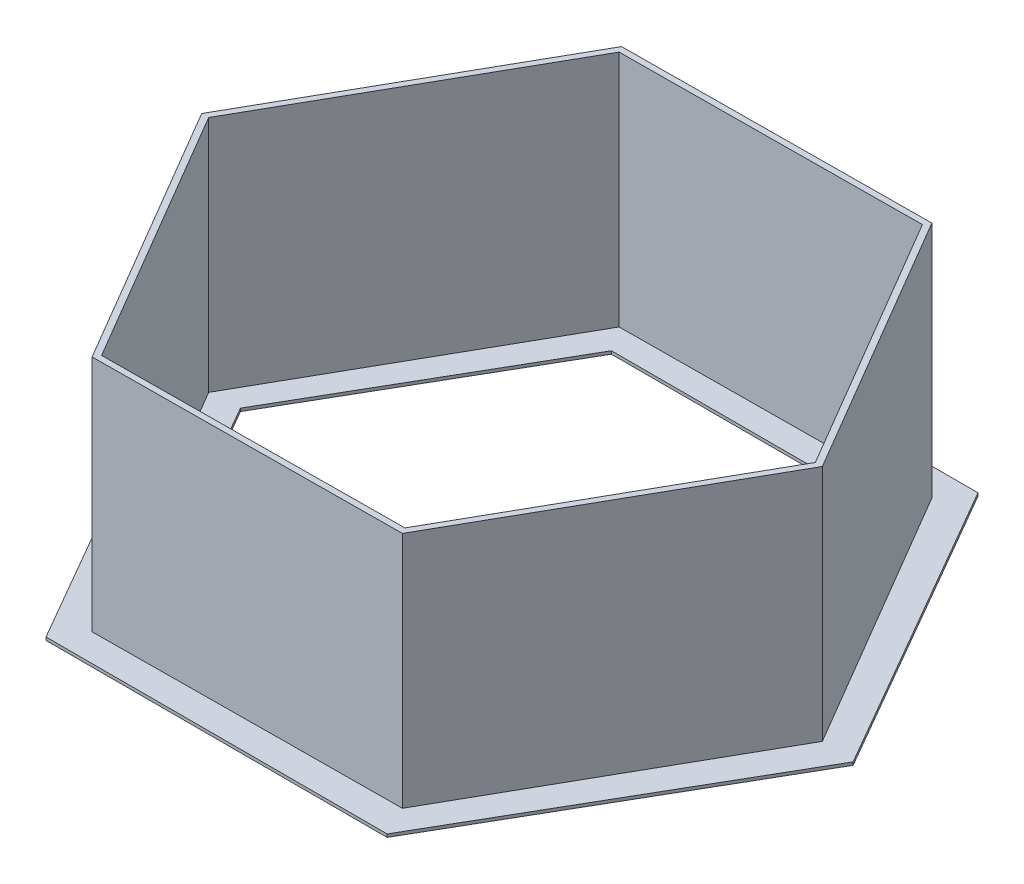
ISO-10303-21;
HEADER;
FILE_DESCRIPTION(('STEP AP214'),'2;1');
FILE_NAME('part.step','',(''),(''),'','','');
FILE_SCHEMA(('AUTOMOTIVE_DESIGN { 1 0 10303 214 1 1 1 1 }'));
ENDSEC;
DATA;
#1=APPLICATION_CONTEXT('core data for automotive mechanical design processes');
#2=APPLICATION_PROTOCOL_DEFINITION('international standard','automotive_design',2000,#1);
#3=PRODUCT_CONTEXT('',#1,'mechanical');
#4=PRODUCT('Part','Part','',(#3));
#5=PRODUCT_RELATED_PRODUCT_CATEGORY('part','',(#4));
#6=PRODUCT_DEFINITION_FORMATION('','',#4);
#7=PRODUCT_DEFINITION_CONTEXT('part definition',#1,'design');
#8=PRODUCT_DEFINITION('design','',#6,#7);
#9=PRODUCT_DEFINITION_SHAPE('','',#8);
#10=(LENGTH_UNIT() NAMED_UNIT(*) SI_UNIT(.MILLI.,.METRE.));
#11=(NAMED_UNIT(*) PLANE_ANGLE_UNIT() SI_UNIT($,.RADIAN.));
#12=(NAMED_UNIT(*) SI_UNIT($,.STERADIAN.) SOLID_ANGLE_UNIT());
#13=UNCERTAINTY_MEASURE_WITH_UNIT(LENGTH_MEASURE(1.E-05),#10,'distance_accuracy_value','');
#14=(GEOMETRIC_REPRESENTATION_CONTEXT(3) GLOBAL_UNCERTAINTY_ASSIGNED_CONTEXT((#13)) GLOBAL_UNIT_ASSIGNED_CONTEXT((#10,
#11,#12)) REPRESENTATION_CONTEXT('',''));
#15=CARTESIAN_POINT('',(0.,0.,0.));
#16=DIRECTION('',(0.,0.,1.));
#17=DIRECTION('',(1.,0.,0.));
#18=AXIS2_PLACEMENT_3D('',#15,#16,#17);
#19=CARTESIAN_POINT('',(0.,2.54,0.));
#20=DIRECTION('',(0.,1.,0.));
#21=DIRECTION('',(0.,0.,1.));
#22=AXIS2_PLACEMENT_3D('',#19,#20,#21);
#23=PLANE('',#22);
#24=DIRECTION('',(1.,0.,0.));
#25=VECTOR('',#24,1.);
#26=CARTESIAN_POINT('',(-143.769509273684,2.54,249.016094641265));
#27=LINE('',#26,#25);
#28=CARTESIAN_POINT('',(-143.769509273684,2.54,249.016094641265));
#29=VERTEX_POINT('',#28);
#30=CARTESIAN_POINT('',(143.769509273684,2.54,249.016094641265));
#31=VERTEX_POINT('',#30);
#32=EDGE_CURVE('E346',#29,#31,#27,.T.);
#33=ORIENTED_EDGE('',*,*,#32,.T.);
#34=DIRECTION('',(0.5,0.,-0.866025403784439));
#35=VECTOR('',#34,1.);
#36=CARTESIAN_POINT('',(143.769509273684,2.54,249.016094641265));
#37=LINE('',#36,#35);
#38=CARTESIAN_POINT('',(287.539018547367,2.54,0.));
#39=VERTEX_POINT('',#38);
#40=EDGE_CURVE('E349',#31,#39,#37,.T.);
#41=ORIENTED_EDGE('',*,*,#40,.T.);
#42=DIRECTION('',(-0.5,0.,-0.866025403784438));
#43=VECTOR('',#42,1.);
#44=CARTESIAN_POINT('',(287.539018547367,2.54,0.));
#45=LINE('',#44,#43);
#46=CARTESIAN_POINT('',(143.769509273683,2.54,-249.016094641265));
#47=VERTEX_POINT('',#46);
#48=EDGE_CURVE('E352',#39,#47,#45,.T.);
#49=ORIENTED_EDGE('',*,*,#48,.T.);
#50=DIRECTION('',(-1.,0.,0.));
#51=VECTOR('',#50,1.);
#52=CARTESIAN_POINT('',(143.769509273683,2.54,-249.016094641265));
#53=LINE('',#52,#51);
#54=CARTESIAN_POINT('',(-143.769509273684,2.54,-249.016094641265));
#55=VERTEX_POINT('',#54);
#56=EDGE_CURVE('E354',#47,#55,#53,.T.);
#57=ORIENTED_EDGE('',*,*,#56,.T.);
#58=DIRECTION('',(-0.5,0.,0.866025403784439));
#59=VECTOR('',#58,1.);
#60=CARTESIAN_POINT('',(-143.769509273684,2.54,-249.016094641265));
#61=LINE('',#60,#59);
#62=CARTESIAN_POINT('',(-287.539018547367,2.54,0.));
#63=VERTEX_POINT('',#62);
#64=EDGE_CURVE('E356',#55,#63,#61,.T.);
#65=ORIENTED_EDGE('',*,*,#64,.T.);
#66=DIRECTION('',(0.5,0.,0.866025403784439));
#67=VECTOR('',#66,1.);
#68=CARTESIAN_POINT('',(-287.539018547367,2.54,0.));
#69=LINE('',#68,#67);
#70=EDGE_CURVE('E358',#63,#29,#69,.T.);
#71=ORIENTED_EDGE('',*,*,#70,.T.);
#72=EDGE_LOOP('',(#33,#41,#49,#57,#65,#71));
#73=FACE_BOUND('',#72,.T.);
#74=DIRECTION('',(0.999971432611545,0.,-0.00755870100052161));
#75=VECTOR('',#74,1.);
#76=CARTESIAN_POINT('',(-1.69953154297277,2.54,-224.837970396992));
#77=LINE('',#76,#75);
#78=CARTESIAN_POINT('',(-131.509794275725,2.53999999999999,-223.85674540316));
#79=VERTEX_POINT('',#78);
#80=CARTESIAN_POINT('',(128.11073118978,2.53999999999999,-225.819195390823));
#81=VERTEX_POINT('',#80);
#82=EDGE_CURVE('E294',#79,#81,#77,.T.);
#83=ORIENTED_EDGE('',*,*,#82,.T.);
#84=DIRECTION('',(0.506531743391835,0.,0.862221313200056));
#85=VECTOR('',#84,1.);
#86=CARTESIAN_POINT('',(193.865628327642,2.54,-113.890822689243));
#87=LINE('',#86,#85);
#88=CARTESIAN_POINT('',(259.620525465505,2.53999999999999,-1.96244998766324));
#89=VERTEX_POINT('',#88);
#90=EDGE_CURVE('E297',#81,#89,#87,.T.);
#91=ORIENTED_EDGE('',*,*,#90,.T.);
#92=DIRECTION('',(-0.493439689219709,0.,0.869780014200578));
#93=VECTOR('',#92,1.);
#94=CARTESIAN_POINT('',(195.565159870615,2.54,110.947147707748));
#95=LINE('',#94,#93);
#96=CARTESIAN_POINT('',(131.509794275725,2.54,223.85674540316));
#97=VERTEX_POINT('',#96);
#98=EDGE_CURVE('E282',#89,#97,#95,.T.);
#99=ORIENTED_EDGE('',*,*,#98,.T.);
#100=DIRECTION('',(-0.999971432611545,0.,0.00755870100052183));
#101=VECTOR('',#100,1.);
#102=CARTESIAN_POINT('',(1.69953154297282,2.54,224.837970396992));
#103=LINE('',#102,#101);
#104=CARTESIAN_POINT('',(-128.110731189779,2.53999999999999,225.819195390824));
#105=VERTEX_POINT('',#104);
#106=EDGE_CURVE('E285',#97,#105,#103,.T.);
#107=ORIENTED_EDGE('',*,*,#106,.T.);
#108=DIRECTION('',(-0.506531743391835,0.,-0.862221313200056));
#109=VECTOR('',#108,1.);
#110=CARTESIAN_POINT('',(-193.865628327642,2.54,113.890822689243));
#111=LINE('',#110,#109);
#112=CARTESIAN_POINT('',(-259.620525465505,2.53999999999999,1.96244998766323));
#113=VERTEX_POINT('',#112);
#114=EDGE_CURVE('E288',#105,#113,#111,.T.);
#115=ORIENTED_EDGE('',*,*,#114,.T.);
#116=DIRECTION('',(0.49343968921971,0.,-0.869780014200577));
#117=VECTOR('',#116,1.);
#118=CARTESIAN_POINT('',(-195.565159870615,2.54,-110.947147707748));
#119=LINE('',#118,#117);
#120=EDGE_CURVE('E291',#113,#79,#119,.T.);
#121=ORIENTED_EDGE('',*,*,#120,.T.);
#122=EDGE_LOOP('',(#83,#91,#99,#107,#115,#121));
#123=FACE_BOUND('',#122,.T.);
#124=ADVANCED_FACE('F33',(#73,#123),#23,.T.);
#125=DIRECTION('',(0.506531743391835,0.,0.862221313200056));
#126=VECTOR('',#125,1.);
#127=CARTESIAN_POINT('',(189.485544056586,2.54,-111.317641432813));
#128=LINE('',#127,#126);
#129=CARTESIAN_POINT('',(125.216273809797,2.54,-220.717171301425));
#130=VERTEX_POINT('',#129);
#131=CARTESIAN_POINT('',(253.754814303375,2.54,-1.91811156420028));
#132=VERTEX_POINT('',#131);
#133=EDGE_CURVE('E56',#130,#132,#128,.T.);
#134=ORIENTED_EDGE('',*,*,#133,.F.);
#135=DIRECTION('',(0.999971432611545,0.,-0.00755870100052148));
#136=VECTOR('',#135,1.);
#137=CARTESIAN_POINT('',(-1.66113334189009,2.54,-219.758115519325));
#138=LINE('',#137,#136);
#139=CARTESIAN_POINT('',(-128.538540493577,2.54,-218.799059737225));
#140=VERTEX_POINT('',#139);
#141=EDGE_CURVE('E211',#140,#130,#138,.T.);
#142=ORIENTED_EDGE('',*,*,#141,.F.);
#143=DIRECTION('',(0.493439689219709,0.,-0.869780014200577));
#144=VECTOR('',#143,1.);
#145=CARTESIAN_POINT('',(-191.146677398476,2.54,-108.440474086512));
#146=LINE('',#145,#144);
#147=CARTESIAN_POINT('',(-253.754814303374,2.54,1.9181115642003));
#148=VERTEX_POINT('',#147);
#149=EDGE_CURVE('E277',#148,#140,#146,.T.);
#150=ORIENTED_EDGE('',*,*,#149,.F.);
#151=DIRECTION('',(-0.506531743391835,0.,-0.862221313200055));
#152=VECTOR('',#151,1.);
#153=CARTESIAN_POINT('',(-189.485544056586,2.54,111.317641432813));
#154=LINE('',#153,#152);
#155=CARTESIAN_POINT('',(-125.216273809797,2.54,220.717171301425));
#156=VERTEX_POINT('',#155);
#157=EDGE_CURVE('E274',#156,#148,#154,.T.);
#158=ORIENTED_EDGE('',*,*,#157,.F.);
#159=DIRECTION('',(-0.999971432611545,0.,0.0075587010005217));
#160=VECTOR('',#159,1.);
#161=CARTESIAN_POINT('',(1.66113334189014,2.54,219.758115519325));
#162=LINE('',#161,#160);
#163=CARTESIAN_POINT('',(128.538540493577,2.53999999999999,218.799059737225));
#164=VERTEX_POINT('',#163);
#165=EDGE_CURVE('E271',#164,#156,#162,.T.);
#166=ORIENTED_EDGE('',*,*,#165,.F.);
#167=DIRECTION('',(-0.493439689219709,0.,0.869780014200577));
#168=VECTOR('',#167,1.);
#169=CARTESIAN_POINT('',(191.146677398476,2.54,108.440474086512));
#170=LINE('',#169,#168);
#171=EDGE_CURVE('E268',#132,#164,#170,.T.);
#172=ORIENTED_EDGE('',*,*,#171,.F.);
#173=EDGE_LOOP('',(#134,#142,#150,#158,#166,#172));
#174=FACE_BOUND('',#173,.T.);
#175=DIRECTION('',(0.5,0.,-0.866025403784439));
#176=VECTOR('',#175,1.);
#177=CARTESIAN_POINT('',(114.440115598851,2.54,198.216094641265));
#178=LINE('',#177,#176);
#179=CARTESIAN_POINT('',(114.440115598851,2.54,198.216094641265));
#180=VERTEX_POINT('',#179);
#181=CARTESIAN_POINT('',(228.880231197701,2.54,0.));
#182=VERTEX_POINT('',#181);
#183=EDGE_CURVE('E303',#180,#182,#178,.T.);
#184=ORIENTED_EDGE('',*,*,#183,.F.);
#185=DIRECTION('',(1.,0.,0.));
#186=VECTOR('',#185,1.);
#187=CARTESIAN_POINT('',(-114.440115598851,2.54,198.216094641265));
#188=LINE('',#187,#186);
#189=CARTESIAN_POINT('',(-114.440115598851,2.54,198.216094641265));
#190=VERTEX_POINT('',#189);
#191=EDGE_CURVE('E301',#190,#180,#188,.T.);
#192=ORIENTED_EDGE('',*,*,#191,.F.);
#193=DIRECTION('',(0.5,0.,0.866025403784439));
#194=VECTOR('',#193,1.);
#195=CARTESIAN_POINT('',(-228.880231197701,2.54,0.));
#196=LINE('',#195,#194);
#197=CARTESIAN_POINT('',(-228.880231197701,2.54,0.));
#198=VERTEX_POINT('',#197);
#199=EDGE_CURVE('E313',#198,#190,#196,.T.);
#200=ORIENTED_EDGE('',*,*,#199,.F.);
#201=DIRECTION('',(-0.5,0.,0.866025403784439));
#202=VECTOR('',#201,1.);
#203=CARTESIAN_POINT('',(-114.440115598851,2.54,-198.216094641265));
#204=LINE('',#203,#202);
#205=CARTESIAN_POINT('',(-114.440115598851,2.54,-198.216094641265));
#206=VERTEX_POINT('',#205);
#207=EDGE_CURVE('E310',#206,#198,#204,.T.);
#208=ORIENTED_EDGE('',*,*,#207,.F.);
#209=DIRECTION('',(-1.,0.,0.));
#210=VECTOR('',#209,1.);
#211=CARTESIAN_POINT('',(114.440115598851,2.54,-198.216094641265));
#212=LINE('',#211,#210);
#213=CARTESIAN_POINT('',(114.440115598851,2.54,-198.216094641265));
#214=VERTEX_POINT('',#213);
#215=EDGE_CURVE('E308',#214,#206,#212,.T.);
#216=ORIENTED_EDGE('',*,*,#215,.F.);
#217=DIRECTION('',(-0.5,0.,-0.866025403784438));
#218=VECTOR('',#217,1.);
#219=CARTESIAN_POINT('',(228.880231197701,2.54,0.));
#220=LINE('',#219,#218);
#221=EDGE_CURVE('E306',#182,#214,#220,.T.);
#222=ORIENTED_EDGE('',*,*,#221,.F.);
#223=EDGE_LOOP('',(#184,#192,#200,#208,#216,#222));
#224=FACE_BOUND('',#223,.T.);
#225=ADVANCED_FACE('F427',(#174,#224),#23,.T.);
#226=CARTESIAN_POINT('',(0.,0.,0.));
#227=DIRECTION('',(0.,1.,0.));
#228=DIRECTION('',(0.,0.,1.));
#229=AXIS2_PLACEMENT_3D('',#226,#227,#228);
#230=PLANE('',#229);
#231=DIRECTION('',(1.,0.,0.));
#232=VECTOR('',#231,1.);
#233=CARTESIAN_POINT('',(-114.440115598851,0.,198.216094641265));
#234=LINE('',#233,#232);
#235=CARTESIAN_POINT('',(-114.440115598851,0.,198.216094641265));
#236=VERTEX_POINT('',#235);
#237=CARTESIAN_POINT('',(114.440115598851,0.,198.216094641265));
#238=VERTEX_POINT('',#237);
#239=EDGE_CURVE('E300',#236,#238,#234,.T.);
#240=ORIENTED_EDGE('',*,*,#239,.T.);
#241=DIRECTION('',(0.5,0.,-0.866025403784439));
#242=VECTOR('',#241,1.);
#243=CARTESIAN_POINT('',(114.440115598851,0.,198.216094641265));
#244=LINE('',#243,#242);
#245=CARTESIAN_POINT('',(228.880231197701,0.,0.));
#246=VERTEX_POINT('',#245);
#247=EDGE_CURVE('E318',#238,#246,#244,.T.);
#248=ORIENTED_EDGE('',*,*,#247,.T.);
#249=DIRECTION('',(-0.5,0.,-0.866025403784438));
#250=VECTOR('',#249,1.);
#251=CARTESIAN_POINT('',(228.880231197701,0.,0.));
#252=LINE('',#251,#250);
#253=CARTESIAN_POINT('',(114.440115598851,0.,-198.216094641265));
#254=VERTEX_POINT('',#253);
#255=EDGE_CURVE('E321',#246,#254,#252,.T.);
#256=ORIENTED_EDGE('',*,*,#255,.T.);
#257=DIRECTION('',(-1.,0.,0.));
#258=VECTOR('',#257,1.);
#259=CARTESIAN_POINT('',(114.440115598851,0.,-198.216094641265));
#260=LINE('',#259,#258);
#261=CARTESIAN_POINT('',(-114.440115598851,0.,-198.216094641265));
#262=VERTEX_POINT('',#261);
#263=EDGE_CURVE('E324',#254,#262,#260,.T.);
#264=ORIENTED_EDGE('',*,*,#263,.T.);
#265=DIRECTION('',(-0.5,0.,0.866025403784439));
#266=VECTOR('',#265,1.);
#267=CARTESIAN_POINT('',(-114.440115598851,0.,-198.216094641265));
#268=LINE('',#267,#266);
#269=CARTESIAN_POINT('',(-228.880231197701,0.,0.));
#270=VERTEX_POINT('',#269);
#271=EDGE_CURVE('E327',#262,#270,#268,.T.);
#272=ORIENTED_EDGE('',*,*,#271,.T.);
#273=DIRECTION('',(0.5,0.,0.866025403784439));
#274=VECTOR('',#273,1.);
#275=CARTESIAN_POINT('',(-228.880231197701,0.,0.));
#276=LINE('',#275,#274);
#277=EDGE_CURVE('E304',#270,#236,#276,.T.);
#278=ORIENTED_EDGE('',*,*,#277,.T.);
#279=EDGE_LOOP('',(#240,#248,#256,#264,#272,#278));
#280=FACE_BOUND('',#279,.T.);
#281=DIRECTION('',(1.,0.,0.));
#282=VECTOR('',#281,1.);
#283=CARTESIAN_POINT('',(-143.769509273684,0.,249.016094641265));
#284=LINE('',#283,#282);
#285=CARTESIAN_POINT('',(-143.769509273684,0.,249.016094641265));
#286=VERTEX_POINT('',#285);
#287=CARTESIAN_POINT('',(143.769509273684,0.,249.016094641265));
#288=VERTEX_POINT('',#287);
#289=EDGE_CURVE('E345',#286,#288,#284,.T.);
#290=ORIENTED_EDGE('',*,*,#289,.F.);
#291=DIRECTION('',(0.5,0.,0.866025403784439));
#292=VECTOR('',#291,1.);
#293=CARTESIAN_POINT('',(-287.539018547367,0.,0.));
#294=LINE('',#293,#292);
#295=CARTESIAN_POINT('',(-287.539018547367,0.,0.));
#296=VERTEX_POINT('',#295);
#297=EDGE_CURVE('E350',#296,#286,#294,.T.);
#298=ORIENTED_EDGE('',*,*,#297,.F.);
#299=DIRECTION('',(-0.5,0.,0.866025403784439));
#300=VECTOR('',#299,1.);
#301=CARTESIAN_POINT('',(-143.769509273684,0.,-249.016094641265));
#302=LINE('',#301,#300);
#303=CARTESIAN_POINT('',(-143.769509273684,0.,-249.016094641265));
#304=VERTEX_POINT('',#303);
#305=EDGE_CURVE('E369',#304,#296,#302,.T.);
#306=ORIENTED_EDGE('',*,*,#305,.F.);
#307=DIRECTION('',(-1.,0.,0.));
#308=VECTOR('',#307,1.);
#309=CARTESIAN_POINT('',(143.769509273683,0.,-249.016094641265));
#310=LINE('',#309,#308);
#311=CARTESIAN_POINT('',(143.769509273683,0.,-249.016094641265));
#312=VERTEX_POINT('',#311);
#313=EDGE_CURVE('E367',#312,#304,#310,.T.);
#314=ORIENTED_EDGE('',*,*,#313,.F.);
#315=DIRECTION('',(-0.5,0.,-0.866025403784438));
#316=VECTOR('',#315,1.);
#317=CARTESIAN_POINT('',(287.539018547367,0.,0.));
#318=LINE('',#317,#316);
#319=CARTESIAN_POINT('',(287.539018547367,0.,0.));
#320=VERTEX_POINT('',#319);
#321=EDGE_CURVE('E365',#320,#312,#318,.T.);
#322=ORIENTED_EDGE('',*,*,#321,.F.);
#323=DIRECTION('',(0.5,0.,-0.866025403784439));
#324=VECTOR('',#323,1.);
#325=CARTESIAN_POINT('',(143.769509273684,0.,249.016094641265));
#326=LINE('',#325,#324);
#327=EDGE_CURVE('E363',#288,#320,#326,.T.);
#328=ORIENTED_EDGE('',*,*,#327,.F.);
#329=EDGE_LOOP('',(#290,#298,#306,#314,#322,#328));
#330=FACE_BOUND('',#329,.T.);
#331=ADVANCED_FACE('F393',(#280,#330),#230,.F.);
#332=CARTESIAN_POINT('',(-143.769509273684,2.54,249.016094641265));
#333=DIRECTION('',(0.,0.,-1.));
#334=DIRECTION('',(-1.,0.,0.));
#335=AXIS2_PLACEMENT_3D('',#332,#333,#334);
#336=PLANE('',#335);
#337=ORIENTED_EDGE('',*,*,#289,.T.);
#338=DIRECTION('',(0.,-1.,0.));
#339=VECTOR('',#338,1.);
#340=CARTESIAN_POINT('',(143.769509273684,2.54,249.016094641265));
#341=LINE('',#340,#339);
#342=EDGE_CURVE('E11',#31,#288,#341,.T.);
#343=ORIENTED_EDGE('',*,*,#342,.F.);
#344=ORIENTED_EDGE('',*,*,#32,.F.);
#345=DIRECTION('',(0.,-1.,0.));
#346=VECTOR('',#345,1.);
#347=CARTESIAN_POINT('',(-143.769509273684,2.54,249.016094641265));
#348=LINE('',#347,#346);
#349=EDGE_CURVE('E360',#29,#286,#348,.T.);
#350=ORIENTED_EDGE('',*,*,#349,.T.);
#351=EDGE_LOOP('',(#337,#343,#344,#350));
#352=FACE_BOUND('',#351,.T.);
#353=ADVANCED_FACE('F35',(#352),#336,.F.);
#354=CARTESIAN_POINT('',(143.769509273684,2.54,249.016094641265));
#355=DIRECTION('',(-0.866025403784439,0.,-0.5));
#356=DIRECTION('',(-0.5,0.,0.866025403784439));
#357=AXIS2_PLACEMENT_3D('',#354,#355,#356);
#358=PLANE('',#357);
#359=ORIENTED_EDGE('',*,*,#327,.T.);
#360=DIRECTION('',(0.,-1.,0.));
#361=VECTOR('',#360,1.);
#362=CARTESIAN_POINT('',(287.539018547367,2.54,0.));
#363=LINE('',#362,#361);
#364=EDGE_CURVE('E41',#39,#320,#363,.T.);
#365=ORIENTED_EDGE('',*,*,#364,.F.);
#366=ORIENTED_EDGE('',*,*,#40,.F.);
#367=ORIENTED_EDGE('',*,*,#342,.T.);
#368=EDGE_LOOP('',(#359,#365,#366,#367));
#369=FACE_BOUND('',#368,.T.);
#370=ADVANCED_FACE('F410',(#369),#358,.F.);
#371=CARTESIAN_POINT('',(287.539018547367,2.54,0.));
#372=DIRECTION('',(-0.866025403784438,0.,0.5));
#373=DIRECTION('',(0.5,0.,0.866025403784438));
#374=AXIS2_PLACEMENT_3D('',#371,#372,#373);
#375=PLANE('',#374);
#376=ORIENTED_EDGE('',*,*,#321,.T.);
#377=DIRECTION('',(0.,-1.,0.));
#378=VECTOR('',#377,1.);
#379=CARTESIAN_POINT('',(143.769509273683,2.54,-249.016094641265));
#380=LINE('',#379,#378);
#381=EDGE_CURVE('E380',#47,#312,#380,.T.);
#382=ORIENTED_EDGE('',*,*,#381,.F.);
#383=ORIENTED_EDGE('',*,*,#48,.F.);
#384=ORIENTED_EDGE('',*,*,#364,.T.);
#385=EDGE_LOOP('',(#376,#382,#383,#384));
#386=FACE_BOUND('',#385,.T.);
#387=ADVANCED_FACE('F387',(#386),#375,.F.);
#388=CARTESIAN_POINT('',(143.769509273683,2.54,-249.016094641265));
#389=DIRECTION('',(0.,0.,1.));
#390=DIRECTION('',(1.,0.,0.));
#391=AXIS2_PLACEMENT_3D('',#388,#389,#390);
#392=PLANE('',#391);
#393=ORIENTED_EDGE('',*,*,#313,.T.);
#394=DIRECTION('',(0.,-1.,0.));
#395=VECTOR('',#394,1.);
#396=CARTESIAN_POINT('',(-143.769509273684,2.54,-249.016094641265));
#397=LINE('',#396,#395);
#398=EDGE_CURVE('E377',#55,#304,#397,.T.);
#399=ORIENTED_EDGE('',*,*,#398,.F.);
#400=ORIENTED_EDGE('',*,*,#56,.F.);
#401=ORIENTED_EDGE('',*,*,#381,.T.);
#402=EDGE_LOOP('',(#393,#399,#400,#401));
#403=FACE_BOUND('',#402,.T.);
#404=ADVANCED_FACE('F398',(#403),#392,.F.);
#405=CARTESIAN_POINT('',(-143.769509273684,2.54,-249.016094641265));
#406=DIRECTION('',(0.866025403784439,0.,0.5));
#407=DIRECTION('',(0.5,0.,-0.866025403784439));
#408=AXIS2_PLACEMENT_3D('',#405,#406,#407);
#409=PLANE('',#408);
#410=ORIENTED_EDGE('',*,*,#305,.T.);
#411=DIRECTION('',(0.,-1.,0.));
#412=VECTOR('',#411,1.);
#413=CARTESIAN_POINT('',(-287.539018547367,2.54,0.));
#414=LINE('',#413,#412);
#415=EDGE_CURVE('E374',#63,#296,#414,.T.);
#416=ORIENTED_EDGE('',*,*,#415,.F.);
#417=ORIENTED_EDGE('',*,*,#64,.F.);
#418=ORIENTED_EDGE('',*,*,#398,.T.);
#419=EDGE_LOOP('',(#410,#416,#417,#418));
#420=FACE_BOUND('',#419,.T.);
#421=ADVANCED_FACE('F402',(#420),#409,.F.);
#422=CARTESIAN_POINT('',(-287.539018547367,2.54,0.));
#423=DIRECTION('',(0.866025403784439,0.,-0.5));
#424=DIRECTION('',(-0.5,0.,-0.866025403784439));
#425=AXIS2_PLACEMENT_3D('',#422,#423,#424);
#426=PLANE('',#425);
#427=ORIENTED_EDGE('',*,*,#297,.T.);
#428=ORIENTED_EDGE('',*,*,#349,.F.);
#429=ORIENTED_EDGE('',*,*,#70,.F.);
#430=ORIENTED_EDGE('',*,*,#415,.T.);
#431=EDGE_LOOP('',(#427,#428,#429,#430));
#432=FACE_BOUND('',#431,.T.);
#433=ADVANCED_FACE('F413',(#432),#426,.F.);
#434=CARTESIAN_POINT('',(-114.440115598851,2.54,198.216094641265));
#435=DIRECTION('',(0.,0.,-1.));
#436=DIRECTION('',(-1.,0.,0.));
#437=AXIS2_PLACEMENT_3D('',#434,#435,#436);
#438=PLANE('',#437);
#439=ORIENTED_EDGE('',*,*,#239,.F.);
#440=DIRECTION('',(0.,-1.,0.));
#441=VECTOR('',#440,1.);
#442=CARTESIAN_POINT('',(-114.440115598851,2.54,198.216094641265));
#443=LINE('',#442,#441);
#444=EDGE_CURVE('E315',#190,#236,#443,.T.);
#445=ORIENTED_EDGE('',*,*,#444,.F.);
#446=ORIENTED_EDGE('',*,*,#191,.T.);
#447=DIRECTION('',(0.,-1.,0.));
#448=VECTOR('',#447,1.);
#449=CARTESIAN_POINT('',(114.440115598851,2.54,198.216094641265));
#450=LINE('',#449,#448);
#451=EDGE_CURVE('E342',#180,#238,#450,.T.);
#452=ORIENTED_EDGE('',*,*,#451,.T.);
#453=EDGE_LOOP('',(#439,#445,#446,#452));
#454=FACE_BOUND('',#453,.T.);
#455=ADVANCED_FACE('F415',(#454),#438,.T.);
#456=CARTESIAN_POINT('',(114.440115598851,2.54,198.216094641265));
#457=DIRECTION('',(-0.866025403784439,0.,-0.5));
#458=DIRECTION('',(-0.5,0.,0.866025403784439));
#459=AXIS2_PLACEMENT_3D('',#456,#457,#458);
#460=PLANE('',#459);
#461=ORIENTED_EDGE('',*,*,#247,.F.);
#462=ORIENTED_EDGE('',*,*,#451,.F.);
#463=ORIENTED_EDGE('',*,*,#183,.T.);
#464=DIRECTION('',(0.,-1.,0.));
#465=VECTOR('',#464,1.);
#466=CARTESIAN_POINT('',(228.880231197701,2.54,0.));
#467=LINE('',#466,#465);
#468=EDGE_CURVE('E340',#182,#246,#467,.T.);
#469=ORIENTED_EDGE('',*,*,#468,.T.);
#470=EDGE_LOOP('',(#461,#462,#463,#469));
#471=FACE_BOUND('',#470,.T.);
#472=ADVANCED_FACE('F421',(#471),#460,.T.);
#473=CARTESIAN_POINT('',(228.880231197701,2.54,0.));
#474=DIRECTION('',(-0.866025403784438,0.,0.5));
#475=DIRECTION('',(0.5,0.,0.866025403784438));
#476=AXIS2_PLACEMENT_3D('',#473,#474,#475);
#477=PLANE('',#476);
#478=ORIENTED_EDGE('',*,*,#255,.F.);
#479=ORIENTED_EDGE('',*,*,#468,.F.);
#480=ORIENTED_EDGE('',*,*,#221,.T.);
#481=DIRECTION('',(0.,-1.,0.));
#482=VECTOR('',#481,1.);
#483=CARTESIAN_POINT('',(114.440115598851,2.54,-198.216094641265));
#484=LINE('',#483,#482);
#485=EDGE_CURVE('E338',#214,#254,#484,.T.);
#486=ORIENTED_EDGE('',*,*,#485,.T.);
#487=EDGE_LOOP('',(#478,#479,#480,#486));
#488=FACE_BOUND('',#487,.T.);
#489=ADVANCED_FACE('F454',(#488),#477,.T.);
#490=CARTESIAN_POINT('',(114.440115598851,2.54,-198.216094641265));
#491=DIRECTION('',(0.,0.,1.));
#492=DIRECTION('',(1.,0.,0.));
#493=AXIS2_PLACEMENT_3D('',#490,#491,#492);
#494=PLANE('',#493);
#495=ORIENTED_EDGE('',*,*,#263,.F.);
#496=ORIENTED_EDGE('',*,*,#485,.F.);
#497=ORIENTED_EDGE('',*,*,#215,.T.);
#498=DIRECTION('',(0.,-1.,0.));
#499=VECTOR('',#498,1.);
#500=CARTESIAN_POINT('',(-114.440115598851,2.54,-198.216094641265));
#501=LINE('',#500,#499);
#502=EDGE_CURVE('E336',#206,#262,#501,.T.);
#503=ORIENTED_EDGE('',*,*,#502,.T.);
#504=EDGE_LOOP('',(#495,#496,#497,#503));
#505=FACE_BOUND('',#504,.T.);
#506=ADVANCED_FACE('F459',(#505),#494,.T.);
#507=CARTESIAN_POINT('',(-114.440115598851,2.54,-198.216094641265));
#508=DIRECTION('',(0.866025403784439,0.,0.5));
#509=DIRECTION('',(0.5,0.,-0.866025403784439));
#510=AXIS2_PLACEMENT_3D('',#507,#508,#509);
#511=PLANE('',#510);
#512=ORIENTED_EDGE('',*,*,#271,.F.);
#513=ORIENTED_EDGE('',*,*,#502,.F.);
#514=ORIENTED_EDGE('',*,*,#207,.T.);
#515=DIRECTION('',(0.,-1.,0.));
#516=VECTOR('',#515,1.);
#517=CARTESIAN_POINT('',(-228.880231197701,2.54,0.));
#518=LINE('',#517,#516);
#519=EDGE_CURVE('E334',#198,#270,#518,.T.);
#520=ORIENTED_EDGE('',*,*,#519,.T.);
#521=EDGE_LOOP('',(#512,#513,#514,#520));
#522=FACE_BOUND('',#521,.T.);
#523=ADVANCED_FACE('F462',(#522),#511,.T.);
#524=CARTESIAN_POINT('',(-228.880231197701,2.54,0.));
#525=DIRECTION('',(0.866025403784438,0.,-0.5));
#526=DIRECTION('',(-0.5,0.,-0.866025403784439));
#527=AXIS2_PLACEMENT_3D('',#524,#525,#526);
#528=PLANE('',#527);
#529=ORIENTED_EDGE('',*,*,#277,.F.);
#530=ORIENTED_EDGE('',*,*,#519,.F.);
#531=ORIENTED_EDGE('',*,*,#199,.T.);
#532=ORIENTED_EDGE('',*,*,#444,.T.);
#533=EDGE_LOOP('',(#529,#530,#531,#532));
#534=FACE_BOUND('',#533,.T.);
#535=ADVANCED_FACE('F443',(#534),#528,.T.);
#536=CARTESIAN_POINT('',(0.,203.2,0.));
#537=DIRECTION('',(0.,1.,0.));
#538=DIRECTION('',(0.,0.,1.));
#539=AXIS2_PLACEMENT_3D('',#536,#537,#538);
#540=PLANE('',#539);
#541=DIRECTION('',(-0.506531743391835,0.,-0.862221313200056));
#542=VECTOR('',#541,1.);
#543=CARTESIAN_POINT('',(259.620525465505,203.2,-1.96244998766324));
#544=LINE('',#543,#542);
#545=CARTESIAN_POINT('',(259.620525465505,203.2,-1.96244998766324));
#546=VERTEX_POINT('',#545);
#547=CARTESIAN_POINT('',(128.11073118978,203.2,-225.819195390823));
#548=VERTEX_POINT('',#547);
#549=EDGE_CURVE('E212',#546,#548,#544,.T.);
#550=ORIENTED_EDGE('',*,*,#549,.T.);
#551=DIRECTION('',(-0.999971432611545,0.,0.00755870100052161));
#552=VECTOR('',#551,1.);
#553=CARTESIAN_POINT('',(128.11073118978,203.2,-225.819195390823));
#554=LINE('',#553,#552);
#555=CARTESIAN_POINT('',(-131.509794275725,203.2,-223.85674540316));
#556=VERTEX_POINT('',#555);
#557=EDGE_CURVE('E242',#548,#556,#554,.T.);
#558=ORIENTED_EDGE('',*,*,#557,.T.);
#559=DIRECTION('',(-0.49343968921971,0.,0.869780014200577));
#560=VECTOR('',#559,1.);
#561=CARTESIAN_POINT('',(-131.509794275725,203.2,-223.85674540316));
#562=LINE('',#561,#560);
#563=CARTESIAN_POINT('',(-259.620525465505,203.2,1.96244998766323));
#564=VERTEX_POINT('',#563);
#565=EDGE_CURVE('E244',#556,#564,#562,.T.);
#566=ORIENTED_EDGE('',*,*,#565,.T.);
#567=DIRECTION('',(0.506531743391835,0.,0.862221313200055));
#568=VECTOR('',#567,1.);
#569=CARTESIAN_POINT('',(-259.620525465505,203.2,1.96244998766323));
#570=LINE('',#569,#568);
#571=CARTESIAN_POINT('',(-128.110731189779,203.2,225.819195390824));
#572=VERTEX_POINT('',#571);
#573=EDGE_CURVE('E246',#564,#572,#570,.T.);
#574=ORIENTED_EDGE('',*,*,#573,.T.);
#575=DIRECTION('',(0.999971432611545,0.,-0.00755870100052183));
#576=VECTOR('',#575,1.);
#577=CARTESIAN_POINT('',(-128.110731189779,203.2,225.819195390824));
#578=LINE('',#577,#576);
#579=CARTESIAN_POINT('',(131.509794275725,203.2,223.85674540316));
#580=VERTEX_POINT('',#579);
#581=EDGE_CURVE('E248',#572,#580,#578,.T.);
#582=ORIENTED_EDGE('',*,*,#581,.T.);
#583=DIRECTION('',(0.493439689219709,0.,-0.869780014200578));
#584=VECTOR('',#583,1.);
#585=CARTESIAN_POINT('',(131.509794275725,203.2,223.85674540316));
#586=LINE('',#585,#584);
#587=EDGE_CURVE('E250',#580,#546,#586,.T.);
#588=ORIENTED_EDGE('',*,*,#587,.T.);
#589=EDGE_LOOP('',(#550,#558,#566,#574,#582,#588));
#590=FACE_BOUND('',#589,.T.);
#591=DIRECTION('',(-0.999971432611545,0.,0.00755870100052148));
#592=VECTOR('',#591,1.);
#593=CARTESIAN_POINT('',(125.216273809797,203.2,-220.717171301425));
#594=LINE('',#593,#592);
#595=CARTESIAN_POINT('',(125.216273809797,203.2,-220.717171301425));
#596=VERTEX_POINT('',#595);
#597=CARTESIAN_POINT('',(-128.538540493577,203.2,-218.799059737225));
#598=VERTEX_POINT('',#597);
#599=EDGE_CURVE('E205',#596,#598,#594,.T.);
#600=ORIENTED_EDGE('',*,*,#599,.F.);
#601=DIRECTION('',(-0.506531743391835,0.,-0.862221313200056));
#602=VECTOR('',#601,1.);
#603=CARTESIAN_POINT('',(253.754814303374,203.2,-1.91811156420028));
#604=LINE('',#603,#602);
#605=CARTESIAN_POINT('',(253.754814303374,203.2,-1.91811156420028));
#606=VERTEX_POINT('',#605);
#607=EDGE_CURVE('E196',#606,#596,#604,.T.);
#608=ORIENTED_EDGE('',*,*,#607,.F.);
#609=DIRECTION('',(0.493439689219709,0.,-0.869780014200577));
#610=VECTOR('',#609,1.);
#611=CARTESIAN_POINT('',(128.538540493577,203.2,218.799059737225));
#612=LINE('',#611,#610);
#613=CARTESIAN_POINT('',(128.538540493578,203.2,218.799059737225));
#614=VERTEX_POINT('',#613);
#615=EDGE_CURVE('E227',#614,#606,#612,.T.);
#616=ORIENTED_EDGE('',*,*,#615,.F.);
#617=DIRECTION('',(0.999971432611545,0.,-0.0075587010005217));
#618=VECTOR('',#617,1.);
#619=CARTESIAN_POINT('',(-125.216273809797,203.2,220.717171301425));
#620=LINE('',#619,#618);
#621=CARTESIAN_POINT('',(-125.216273809797,203.2,220.717171301425));
#622=VERTEX_POINT('',#621);
#623=EDGE_CURVE('E224',#622,#614,#620,.T.);
#624=ORIENTED_EDGE('',*,*,#623,.F.);
#625=DIRECTION('',(0.506531743391835,0.,0.862221313200055));
#626=VECTOR('',#625,1.);
#627=CARTESIAN_POINT('',(-253.754814303374,203.2,1.9181115642003));
#628=LINE('',#627,#626);
#629=CARTESIAN_POINT('',(-253.754814303374,203.2,1.9181115642003));
#630=VERTEX_POINT('',#629);
#631=EDGE_CURVE('E220',#630,#622,#628,.T.);
#632=ORIENTED_EDGE('',*,*,#631,.F.);
#633=DIRECTION('',(-0.49343968921971,0.,0.869780014200577));
#634=VECTOR('',#633,1.);
#635=CARTESIAN_POINT('',(-128.538540493577,203.2,-218.799059737225));
#636=LINE('',#635,#634);
#637=EDGE_CURVE('E218',#598,#630,#636,.T.);
#638=ORIENTED_EDGE('',*,*,#637,.F.);
#639=EDGE_LOOP('',(#600,#608,#616,#624,#632,#638));
#640=FACE_BOUND('',#639,.T.);
#641=ADVANCED_FACE('F216',(#590,#640),#540,.T.);
#642=CARTESIAN_POINT('',(259.620525465505,203.2,-1.96244998766324));
#643=DIRECTION('',(-0.862221313200055,0.,0.506531743391835));
#644=DIRECTION('',(0.506531743391835,0.,0.862221313200056));
#645=AXIS2_PLACEMENT_3D('',#642,#643,#644);
#646=PLANE('',#645);
#647=ORIENTED_EDGE('',*,*,#90,.F.);
#648=DIRECTION('',(0.,-1.,0.));
#649=VECTOR('',#648,1.);
#650=CARTESIAN_POINT('',(128.11073118978,203.2,-225.819195390823));
#651=LINE('',#650,#649);
#652=EDGE_CURVE('E265',#548,#81,#651,.T.);
#653=ORIENTED_EDGE('',*,*,#652,.F.);
#654=ORIENTED_EDGE('',*,*,#549,.F.);
#655=DIRECTION('',(0.,-1.,0.));
#656=VECTOR('',#655,1.);
#657=CARTESIAN_POINT('',(259.620525465505,203.2,-1.96244998766324));
#658=LINE('',#657,#656);
#659=EDGE_CURVE('E252',#546,#89,#658,.T.);
#660=ORIENTED_EDGE('',*,*,#659,.T.);
#661=EDGE_LOOP('',(#647,#653,#654,#660));
#662=FACE_BOUND('',#661,.T.);
#663=ADVANCED_FACE('F521',(#662),#646,.F.);
#664=CARTESIAN_POINT('',(128.11073118978,203.2,-225.819195390823));
#665=DIRECTION('',(0.00755870100052161,0.,0.999971432611545));
#666=DIRECTION('',(0.999971432611545,0.,-0.00755870100052161));
#667=AXIS2_PLACEMENT_3D('',#664,#665,#666);
#668=PLANE('',#667);
#669=ORIENTED_EDGE('',*,*,#82,.F.);
#670=DIRECTION('',(0.,-1.,0.));
#671=VECTOR('',#670,1.);
#672=CARTESIAN_POINT('',(-131.509794275725,203.2,-223.85674540316));
#673=LINE('',#672,#671);
#674=EDGE_CURVE('E262',#556,#79,#673,.T.);
#675=ORIENTED_EDGE('',*,*,#674,.F.);
#676=ORIENTED_EDGE('',*,*,#557,.F.);
#677=ORIENTED_EDGE('',*,*,#652,.T.);
#678=EDGE_LOOP('',(#669,#675,#676,#677));
#679=FACE_BOUND('',#678,.T.);
#680=ADVANCED_FACE('F531',(#679),#668,.F.);
#681=CARTESIAN_POINT('',(-131.509794275725,203.2,-223.85674540316));
#682=DIRECTION('',(0.869780014200577,0.,0.49343968921971));
#683=DIRECTION('',(0.49343968921971,0.,-0.869780014200577));
#684=AXIS2_PLACEMENT_3D('',#681,#682,#683);
#685=PLANE('',#684);
#686=ORIENTED_EDGE('',*,*,#120,.F.);
#687=DIRECTION('',(0.,-1.,0.));
#688=VECTOR('',#687,1.);
#689=CARTESIAN_POINT('',(-259.620525465505,203.2,1.96244998766323));
#690=LINE('',#689,#688);
#691=EDGE_CURVE('E259',#564,#113,#690,.T.);
#692=ORIENTED_EDGE('',*,*,#691,.F.);
#693=ORIENTED_EDGE('',*,*,#565,.F.);
#694=ORIENTED_EDGE('',*,*,#674,.T.);
#695=EDGE_LOOP('',(#686,#692,#693,#694));
#696=FACE_BOUND('',#695,.T.);
#697=ADVANCED_FACE('F540',(#696),#685,.F.);
#698=CARTESIAN_POINT('',(-259.620525465505,203.2,1.96244998766323));
#699=DIRECTION('',(0.862221313200055,0.,-0.506531743391835));
#700=DIRECTION('',(-0.506531743391835,0.,-0.862221313200056));
#701=AXIS2_PLACEMENT_3D('',#698,#699,#700);
#702=PLANE('',#701);
#703=ORIENTED_EDGE('',*,*,#114,.F.);
#704=DIRECTION('',(0.,-1.,0.));
#705=VECTOR('',#704,1.);
#706=CARTESIAN_POINT('',(-128.110731189779,203.2,225.819195390824));
#707=LINE('',#706,#705);
#708=EDGE_CURVE('E256',#572,#105,#707,.T.);
#709=ORIENTED_EDGE('',*,*,#708,.F.);
#710=ORIENTED_EDGE('',*,*,#573,.F.);
#711=ORIENTED_EDGE('',*,*,#691,.T.);
#712=EDGE_LOOP('',(#703,#709,#710,#711));
#713=FACE_BOUND('',#712,.T.);
#714=ADVANCED_FACE('F550',(#713),#702,.F.);
#715=CARTESIAN_POINT('',(-128.110731189779,203.2,225.819195390824));
#716=DIRECTION('',(-0.00755870100052183,0.,-0.999971432611545));
#717=DIRECTION('',(-0.999971432611545,0.,0.00755870100052183));
#718=AXIS2_PLACEMENT_3D('',#715,#716,#717);
#719=PLANE('',#718);
#720=ORIENTED_EDGE('',*,*,#106,.F.);
#721=DIRECTION('',(0.,-1.,0.));
#722=VECTOR('',#721,1.);
#723=CARTESIAN_POINT('',(131.509794275725,203.2,223.85674540316));
#724=LINE('',#723,#722);
#725=EDGE_CURVE('E48',#580,#97,#724,.T.);
#726=ORIENTED_EDGE('',*,*,#725,.F.);
#727=ORIENTED_EDGE('',*,*,#581,.F.);
#728=ORIENTED_EDGE('',*,*,#708,.T.);
#729=EDGE_LOOP('',(#720,#726,#727,#728));
#730=FACE_BOUND('',#729,.T.);
#731=ADVANCED_FACE('F560',(#730),#719,.F.);
#732=CARTESIAN_POINT('',(131.509794275725,203.2,223.85674540316));
#733=DIRECTION('',(-0.869780014200577,0.,-0.493439689219709));
#734=DIRECTION('',(-0.493439689219709,0.,0.869780014200578));
#735=AXIS2_PLACEMENT_3D('',#732,#733,#734);
#736=PLANE('',#735);
#737=ORIENTED_EDGE('',*,*,#98,.F.);
#738=ORIENTED_EDGE('',*,*,#659,.F.);
#739=ORIENTED_EDGE('',*,*,#587,.F.);
#740=ORIENTED_EDGE('',*,*,#725,.T.);
#741=EDGE_LOOP('',(#737,#738,#739,#740));
#742=FACE_BOUND('',#741,.T.);
#743=ADVANCED_FACE('F570',(#742),#736,.F.);
#744=CARTESIAN_POINT('',(253.754814303374,203.2,-1.91811156420028));
#745=DIRECTION('',(-0.862221313200055,0.,0.506531743391835));
#746=DIRECTION('',(0.506531743391835,0.,0.862221313200056));
#747=AXIS2_PLACEMENT_3D('',#744,#745,#746);
#748=PLANE('',#747);
#749=DIRECTION('',(0.,-1.,0.));
#750=VECTOR('',#749,1.);
#751=CARTESIAN_POINT('',(125.216273809797,203.2,-220.717171301425));
#752=LINE('',#751,#750);
#753=EDGE_CURVE('E199',#596,#130,#752,.T.);
#754=ORIENTED_EDGE('',*,*,#753,.T.);
#755=ORIENTED_EDGE('',*,*,#133,.T.);
#756=DIRECTION('',(0.,-1.,0.));
#757=VECTOR('',#756,1.);
#758=CARTESIAN_POINT('',(253.754814303374,203.2,-1.91811156420028));
#759=LINE('',#758,#757);
#760=EDGE_CURVE('E201',#606,#132,#759,.T.);
#761=ORIENTED_EDGE('',*,*,#760,.F.);
#762=ORIENTED_EDGE('',*,*,#607,.T.);
#763=EDGE_LOOP('',(#754,#755,#761,#762));
#764=FACE_BOUND('',#763,.T.);
#765=ADVANCED_FACE('F198',(#764),#748,.T.);
#766=CARTESIAN_POINT('',(125.216273809797,203.2,-220.717171301425));
#767=DIRECTION('',(0.00755870100052148,0.,0.999971432611545));
#768=DIRECTION('',(0.999971432611545,0.,-0.00755870100052148));
#769=AXIS2_PLACEMENT_3D('',#766,#767,#768);
#770=PLANE('',#769);
#771=DIRECTION('',(0.,-1.,0.));
#772=VECTOR('',#771,1.);
#773=CARTESIAN_POINT('',(-128.538540493577,203.2,-218.799059737225));
#774=LINE('',#773,#772);
#775=EDGE_CURVE('E213',#598,#140,#774,.T.);
#776=ORIENTED_EDGE('',*,*,#775,.T.);
#777=ORIENTED_EDGE('',*,*,#141,.T.);
#778=ORIENTED_EDGE('',*,*,#753,.F.);
#779=ORIENTED_EDGE('',*,*,#599,.T.);
#780=EDGE_LOOP('',(#776,#777,#778,#779));
#781=FACE_BOUND('',#780,.T.);
#782=ADVANCED_FACE('F209',(#781),#770,.T.);
#783=CARTESIAN_POINT('',(-128.538540493577,203.2,-218.799059737225));
#784=DIRECTION('',(0.869780014200577,0.,0.493439689219709));
#785=DIRECTION('',(0.493439689219709,0.,-0.869780014200577));
#786=AXIS2_PLACEMENT_3D('',#783,#784,#785);
#787=PLANE('',#786);
#788=DIRECTION('',(0.,-1.,0.));
#789=VECTOR('',#788,1.);
#790=CARTESIAN_POINT('',(-253.754814303374,203.2,1.9181115642003));
#791=LINE('',#790,#789);
#792=EDGE_CURVE('E236',#630,#148,#791,.T.);
#793=ORIENTED_EDGE('',*,*,#792,.T.);
#794=ORIENTED_EDGE('',*,*,#149,.T.);
#795=ORIENTED_EDGE('',*,*,#775,.F.);
#796=ORIENTED_EDGE('',*,*,#637,.T.);
#797=EDGE_LOOP('',(#793,#794,#795,#796));
#798=FACE_BOUND('',#797,.T.);
#799=ADVANCED_FACE('F596',(#798),#787,.T.);
#800=CARTESIAN_POINT('',(-253.754814303374,203.2,1.9181115642003));
#801=DIRECTION('',(0.862221313200055,0.,-0.506531743391835));
#802=DIRECTION('',(-0.506531743391835,0.,-0.862221313200055));
#803=AXIS2_PLACEMENT_3D('',#800,#801,#802);
#804=PLANE('',#803);
#805=DIRECTION('',(0.,-1.,0.));
#806=VECTOR('',#805,1.);
#807=CARTESIAN_POINT('',(-125.216273809797,203.2,220.717171301425));
#808=LINE('',#807,#806);
#809=EDGE_CURVE('E233',#622,#156,#808,.T.);
#810=ORIENTED_EDGE('',*,*,#809,.T.);
#811=ORIENTED_EDGE('',*,*,#157,.T.);
#812=ORIENTED_EDGE('',*,*,#792,.F.);
#813=ORIENTED_EDGE('',*,*,#631,.T.);
#814=EDGE_LOOP('',(#810,#811,#812,#813));
#815=FACE_BOUND('',#814,.T.);
#816=ADVANCED_FACE('F605',(#815),#804,.T.);
#817=CARTESIAN_POINT('',(-125.216273809797,203.2,220.717171301425));
#818=DIRECTION('',(-0.0075587010005217,0.,-0.999971432611545));
#819=DIRECTION('',(-0.999971432611545,0.,0.0075587010005217));
#820=AXIS2_PLACEMENT_3D('',#817,#818,#819);
#821=PLANE('',#820);
#822=DIRECTION('',(0.,-1.,0.));
#823=VECTOR('',#822,1.);
#824=CARTESIAN_POINT('',(128.538540493577,203.2,218.799059737225));
#825=LINE('',#824,#823);
#826=EDGE_CURVE('E230',#614,#164,#825,.T.);
#827=ORIENTED_EDGE('',*,*,#826,.T.);
#828=ORIENTED_EDGE('',*,*,#165,.T.);
#829=ORIENTED_EDGE('',*,*,#809,.F.);
#830=ORIENTED_EDGE('',*,*,#623,.T.);
#831=EDGE_LOOP('',(#827,#828,#829,#830));
#832=FACE_BOUND('',#831,.T.);
#833=ADVANCED_FACE('F615',(#832),#821,.T.);
#834=CARTESIAN_POINT('',(128.538540493577,203.2,218.799059737225));
#835=DIRECTION('',(-0.869780014200577,0.,-0.493439689219709));
#836=DIRECTION('',(-0.493439689219709,0.,0.869780014200577));
#837=AXIS2_PLACEMENT_3D('',#834,#835,#836);
#838=PLANE('',#837);
#839=ORIENTED_EDGE('',*,*,#760,.T.);
#840=ORIENTED_EDGE('',*,*,#171,.T.);
#841=ORIENTED_EDGE('',*,*,#826,.F.);
#842=ORIENTED_EDGE('',*,*,#615,.T.);
#843=EDGE_LOOP('',(#839,#840,#841,#842));
#844=FACE_BOUND('',#843,.T.);
#845=ADVANCED_FACE('F625',(#844),#838,.T.);
#846=CLOSED_SHELL('',(#124,#225,#331,#353,#370,#387,#404,#421,#433,#455,#472,#489,#506,#523,
#535,#641,#663,#680,#697,#714,#731,#743,#765,#782,#799,#816,#833,#845));
#847=MANIFOLD_SOLID_BREP('B2',#846);
#848=ADVANCED_BREP_SHAPE_REPRESENTATION('',(#18,#847),#14);
#849=SHAPE_DEFINITION_REPRESENTATION(#9,#848);
ENDSEC;
END-ISO-10303-21;
